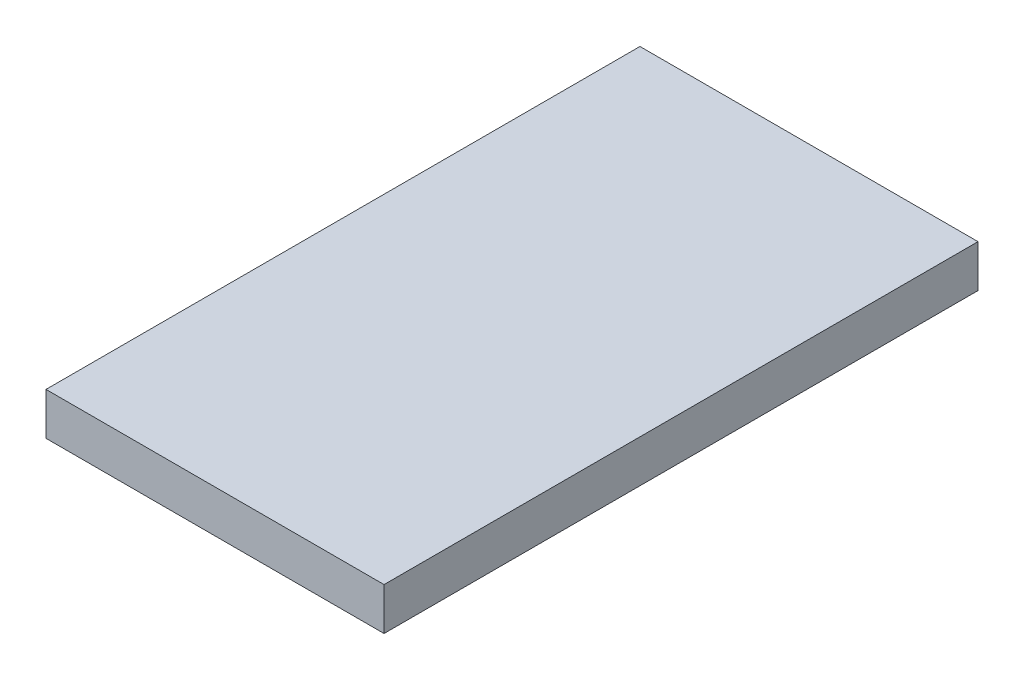
ISO-10303-21;
HEADER;
FILE_DESCRIPTION(('STEP AP214'),'2;1');
FILE_NAME('part.step','',(''),(''),'','','');
FILE_SCHEMA(('AUTOMOTIVE_DESIGN { 1 0 10303 214 1 1 1 1 }'));
ENDSEC;
DATA;
#1=APPLICATION_CONTEXT('core data for automotive mechanical design processes');
#2=APPLICATION_PROTOCOL_DEFINITION('international standard','automotive_design',2000,#1);
#3=PRODUCT_CONTEXT('',#1,'mechanical');
#4=PRODUCT('Part','Part','',(#3));
#5=PRODUCT_RELATED_PRODUCT_CATEGORY('part','',(#4));
#6=PRODUCT_DEFINITION_FORMATION('','',#4);
#7=PRODUCT_DEFINITION_CONTEXT('part definition',#1,'design');
#8=PRODUCT_DEFINITION('design','',#6,#7);
#9=PRODUCT_DEFINITION_SHAPE('','',#8);
#10=(LENGTH_UNIT() NAMED_UNIT(*) SI_UNIT(.MILLI.,.METRE.));
#11=(NAMED_UNIT(*) PLANE_ANGLE_UNIT() SI_UNIT($,.RADIAN.));
#12=(NAMED_UNIT(*) SI_UNIT($,.STERADIAN.) SOLID_ANGLE_UNIT());
#13=UNCERTAINTY_MEASURE_WITH_UNIT(LENGTH_MEASURE(1.E-05),#10,'distance_accuracy_value','');
#14=(GEOMETRIC_REPRESENTATION_CONTEXT(3) GLOBAL_UNCERTAINTY_ASSIGNED_CONTEXT((#13)) GLOBAL_UNIT_ASSIGNED_CONTEXT((#10,
#11,#12)) REPRESENTATION_CONTEXT('',''));
#15=CARTESIAN_POINT('',(0.,0.,0.));
#16=DIRECTION('',(0.,0.,1.));
#17=DIRECTION('',(1.,0.,0.));
#18=AXIS2_PLACEMENT_3D('',#15,#16,#17);
#19=CARTESIAN_POINT('',(0.,21.,0.));
#20=DIRECTION('',(1.,0.,0.));
#21=DIRECTION('',(0.,0.,-1.));
#22=AXIS2_PLACEMENT_3D('',#19,#20,#21);
#23=PLANE('',#22);
#24=DIRECTION('',(0.,0.,1.));
#25=VECTOR('',#24,1.);
#26=CARTESIAN_POINT('',(0.,0.,0.));
#27=LINE('',#26,#25);
#28=CARTESIAN_POINT('',(0.,0.,-294.153134808344));
#29=VERTEX_POINT('',#28);
#30=CARTESIAN_POINT('',(0.,0.,0.));
#31=VERTEX_POINT('',#30);
#32=EDGE_CURVE('E106',#29,#31,#27,.T.);
#33=ORIENTED_EDGE('',*,*,#32,.T.);
#34=DIRECTION('',(0.,-1.,0.));
#35=VECTOR('',#34,1.);
#36=CARTESIAN_POINT('',(0.,21.,0.));
#37=LINE('',#36,#35);
#38=CARTESIAN_POINT('',(0.,21.,0.));
#39=VERTEX_POINT('',#38);
#40=EDGE_CURVE('E11',#39,#31,#37,.T.);
#41=ORIENTED_EDGE('',*,*,#40,.F.);
#42=DIRECTION('',(0.,0.,1.));
#43=VECTOR('',#42,1.);
#44=CARTESIAN_POINT('',(0.,21.,0.));
#45=LINE('',#44,#43);
#46=CARTESIAN_POINT('',(0.,21.,-294.153134808344));
#47=VERTEX_POINT('',#46);
#48=EDGE_CURVE('E94',#47,#39,#45,.T.);
#49=ORIENTED_EDGE('',*,*,#48,.F.);
#50=DIRECTION('',(0.,-1.,0.));
#51=VECTOR('',#50,1.);
#52=CARTESIAN_POINT('',(0.,21.,-294.153134808344));
#53=LINE('',#52,#51);
#54=EDGE_CURVE('E102',#47,#29,#53,.T.);
#55=ORIENTED_EDGE('',*,*,#54,.T.);
#56=EDGE_LOOP('',(#33,#41,#49,#55));
#57=FACE_BOUND('',#56,.T.);
#58=ADVANCED_FACE('F43',(#57),#23,.F.);
#59=CARTESIAN_POINT('',(0.,21.,0.));
#60=DIRECTION('',(0.,0.,-1.));
#61=DIRECTION('',(-1.,0.,0.));
#62=AXIS2_PLACEMENT_3D('',#59,#60,#61);
#63=PLANE('',#62);
#64=DIRECTION('',(1.,0.,0.));
#65=VECTOR('',#64,1.);
#66=CARTESIAN_POINT('',(0.,0.,0.));
#67=LINE('',#66,#65);
#68=CARTESIAN_POINT('',(167.418688723484,0.,0.));
#69=VERTEX_POINT('',#68);
#70=EDGE_CURVE('E98',#31,#69,#67,.T.);
#71=ORIENTED_EDGE('',*,*,#70,.T.);
#72=DIRECTION('',(0.,-1.,0.));
#73=VECTOR('',#72,1.);
#74=CARTESIAN_POINT('',(167.418688723484,21.,0.));
#75=LINE('',#74,#73);
#76=CARTESIAN_POINT('',(167.418688723484,21.,0.));
#77=VERTEX_POINT('',#76);
#78=EDGE_CURVE('E51',#77,#69,#75,.T.);
#79=ORIENTED_EDGE('',*,*,#78,.F.);
#80=DIRECTION('',(1.,0.,0.));
#81=VECTOR('',#80,1.);
#82=CARTESIAN_POINT('',(0.,21.,0.));
#83=LINE('',#82,#81);
#84=EDGE_CURVE('E89',#39,#77,#83,.T.);
#85=ORIENTED_EDGE('',*,*,#84,.F.);
#86=ORIENTED_EDGE('',*,*,#40,.T.);
#87=EDGE_LOOP('',(#71,#79,#85,#86));
#88=FACE_BOUND('',#87,.T.);
#89=ADVANCED_FACE('F97',(#88),#63,.F.);
#90=CARTESIAN_POINT('',(167.418688723484,21.,0.));
#91=DIRECTION('',(-1.,0.,0.));
#92=DIRECTION('',(0.,0.,1.));
#93=AXIS2_PLACEMENT_3D('',#90,#91,#92);
#94=PLANE('',#93);
#95=DIRECTION('',(0.,0.,-1.));
#96=VECTOR('',#95,1.);
#97=CARTESIAN_POINT('',(167.418688723484,0.,0.));
#98=LINE('',#97,#96);
#99=CARTESIAN_POINT('',(167.418688723484,0.,-294.153134808344));
#100=VERTEX_POINT('',#99);
#101=EDGE_CURVE('E76',#69,#100,#98,.T.);
#102=ORIENTED_EDGE('',*,*,#101,.T.);
#103=DIRECTION('',(0.,-1.,0.));
#104=VECTOR('',#103,1.);
#105=CARTESIAN_POINT('',(167.418688723484,21.,-294.153134808344));
#106=LINE('',#105,#104);
#107=CARTESIAN_POINT('',(167.418688723484,21.,-294.153134808344));
#108=VERTEX_POINT('',#107);
#109=EDGE_CURVE('E99',#108,#100,#106,.T.);
#110=ORIENTED_EDGE('',*,*,#109,.F.);
#111=DIRECTION('',(0.,0.,-1.));
#112=VECTOR('',#111,1.);
#113=CARTESIAN_POINT('',(167.418688723484,21.,0.));
#114=LINE('',#113,#112);
#115=EDGE_CURVE('E92',#77,#108,#114,.T.);
#116=ORIENTED_EDGE('',*,*,#115,.F.);
#117=ORIENTED_EDGE('',*,*,#78,.T.);
#118=EDGE_LOOP('',(#102,#110,#116,#117));
#119=FACE_BOUND('',#118,.T.);
#120=ADVANCED_FACE('F100',(#119),#94,.F.);
#121=CARTESIAN_POINT('',(0.,21.,-294.153134808344));
#122=DIRECTION('',(0.,0.,1.));
#123=DIRECTION('',(1.,0.,0.));
#124=AXIS2_PLACEMENT_3D('',#121,#122,#123);
#125=PLANE('',#124);
#126=DIRECTION('',(-1.,0.,0.));
#127=VECTOR('',#126,1.);
#128=CARTESIAN_POINT('',(0.,0.,-294.153134808344));
#129=LINE('',#128,#127);
#130=EDGE_CURVE('E82',#100,#29,#129,.T.);
#131=ORIENTED_EDGE('',*,*,#130,.T.);
#132=ORIENTED_EDGE('',*,*,#54,.F.);
#133=DIRECTION('',(-1.,0.,0.));
#134=VECTOR('',#133,1.);
#135=CARTESIAN_POINT('',(0.,21.,-294.153134808344));
#136=LINE('',#135,#134);
#137=EDGE_CURVE('E59',#108,#47,#136,.T.);
#138=ORIENTED_EDGE('',*,*,#137,.F.);
#139=ORIENTED_EDGE('',*,*,#109,.T.);
#140=EDGE_LOOP('',(#131,#132,#138,#139));
#141=FACE_BOUND('',#140,.T.);
#142=ADVANCED_FACE('F113',(#141),#125,.F.);
#143=CARTESIAN_POINT('',(0.,21.,0.));
#144=DIRECTION('',(0.,-1.,0.));
#145=DIRECTION('',(0.,0.,-1.));
#146=AXIS2_PLACEMENT_3D('',#143,#144,#145);
#147=PLANE('',#146);
#148=ORIENTED_EDGE('',*,*,#48,.T.);
#149=ORIENTED_EDGE('',*,*,#84,.T.);
#150=ORIENTED_EDGE('',*,*,#115,.T.);
#151=ORIENTED_EDGE('',*,*,#137,.T.);
#152=EDGE_LOOP('',(#148,#149,#150,#151));
#153=FACE_BOUND('',#152,.T.);
#154=ADVANCED_FACE('F90',(#153),#147,.F.);
#155=CARTESIAN_POINT('',(0.,0.,0.));
#156=DIRECTION('',(0.,-1.,0.));
#157=DIRECTION('',(0.,0.,-1.));
#158=AXIS2_PLACEMENT_3D('',#155,#156,#157);
#159=PLANE('',#158);
#160=ORIENTED_EDGE('',*,*,#32,.F.);
#161=ORIENTED_EDGE('',*,*,#130,.F.);
#162=ORIENTED_EDGE('',*,*,#101,.F.);
#163=ORIENTED_EDGE('',*,*,#70,.F.);
#164=EDGE_LOOP('',(#160,#161,#162,#163));
#165=FACE_BOUND('',#164,.T.);
#166=ADVANCED_FACE('F116',(#165),#159,.T.);
#167=CLOSED_SHELL('',(#58,#89,#120,#142,#154,#166));
#168=MANIFOLD_SOLID_BREP('B2',#167);
#169=ADVANCED_BREP_SHAPE_REPRESENTATION('',(#18,#168),#14);
#170=SHAPE_DEFINITION_REPRESENTATION(#9,#169);
ENDSEC;
END-ISO-10303-21;
